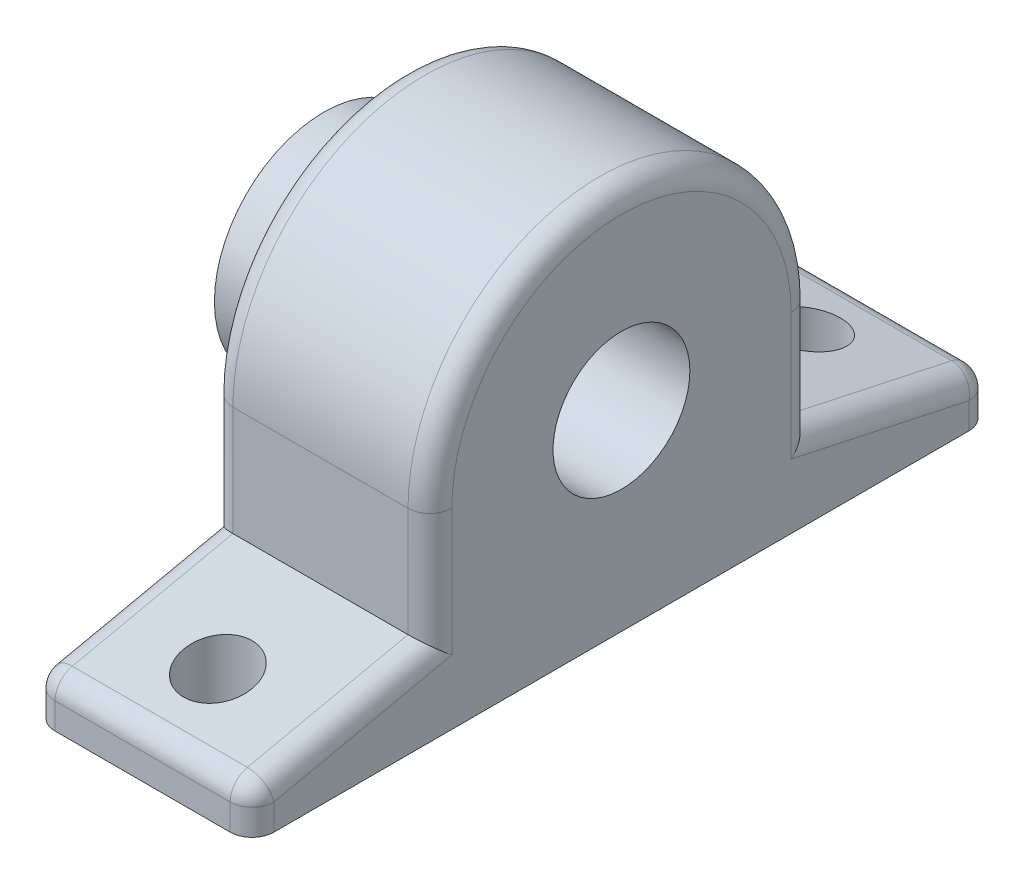
ISO-10303-21;
HEADER;
FILE_DESCRIPTION(('STEP AP214'),'2;1');
FILE_NAME('part.step','',(''),(''),'','','');
FILE_SCHEMA(('AUTOMOTIVE_DESIGN { 1 0 10303 214 1 1 1 1 }'));
ENDSEC;
DATA;
#1=APPLICATION_CONTEXT('core data for automotive mechanical design processes');
#2=APPLICATION_PROTOCOL_DEFINITION('international standard','automotive_design',2000,#1);
#3=PRODUCT_CONTEXT('',#1,'mechanical');
#4=PRODUCT('Part','Part','',(#3));
#5=PRODUCT_RELATED_PRODUCT_CATEGORY('part','',(#4));
#6=PRODUCT_DEFINITION_FORMATION('','',#4);
#7=PRODUCT_DEFINITION_CONTEXT('part definition',#1,'design');
#8=PRODUCT_DEFINITION('design','',#6,#7);
#9=PRODUCT_DEFINITION_SHAPE('','',#8);
#10=(LENGTH_UNIT() NAMED_UNIT(*) SI_UNIT(.MILLI.,.METRE.));
#11=(NAMED_UNIT(*) PLANE_ANGLE_UNIT() SI_UNIT($,.RADIAN.));
#12=(NAMED_UNIT(*) SI_UNIT($,.STERADIAN.) SOLID_ANGLE_UNIT());
#13=UNCERTAINTY_MEASURE_WITH_UNIT(LENGTH_MEASURE(1.E-05),#10,'distance_accuracy_value','');
#14=(GEOMETRIC_REPRESENTATION_CONTEXT(3) GLOBAL_UNCERTAINTY_ASSIGNED_CONTEXT((#13)) GLOBAL_UNIT_ASSIGNED_CONTEXT((#10,
#11,#12)) REPRESENTATION_CONTEXT('',''));
#15=CARTESIAN_POINT('',(0.,0.,0.));
#16=DIRECTION('',(0.,0.,1.));
#17=DIRECTION('',(1.,0.,0.));
#18=AXIS2_PLACEMENT_3D('',#15,#16,#17);
#19=CARTESIAN_POINT('',(0.,-15.6978882213575,-80.5063720271761));
#20=DIRECTION('',(1.,0.,0.));
#21=DIRECTION('',(0.,0.,-1.));
#22=AXIS2_PLACEMENT_3D('',#19,#20,#21);
#23=PLANE('',#22);
#24=DIRECTION('',(0.,-0.210556075945089,-0.977581781173629));
#25=VECTOR('',#24,1.);
#26=CARTESIAN_POINT('',(0.,-19.628057724181,-42.3276875670995));
#27=LINE('',#26,#25);
#28=CARTESIAN_POINT('',(0.,-14.7511711712673,-19.685));
#29=VERTEX_POINT('',#28);
#30=CARTESIAN_POINT('',(0.,-19.1961711712673,-40.3225));
#31=VERTEX_POINT('',#30);
#32=EDGE_CURVE('E231',#29,#31,#27,.T.);
#33=ORIENTED_EDGE('',*,*,#32,.T.);
#34=DIRECTION('',(0.,1.,0.));
#35=VECTOR('',#34,1.);
#36=CARTESIAN_POINT('',(0.,-15.6978882213575,-40.3225));
#37=LINE('',#36,#35);
#38=CARTESIAN_POINT('',(0.,-22.225,-40.3225));
#39=VERTEX_POINT('',#38);
#40=EDGE_CURVE('E244',#31,#39,#37,.F.);
#41=ORIENTED_EDGE('',*,*,#40,.T.);
#42=DIRECTION('',(0.,0.,1.));
#43=VECTOR('',#42,1.);
#44=CARTESIAN_POINT('',(0.,-22.225,-80.5063720271761));
#45=LINE('',#44,#43);
#46=CARTESIAN_POINT('',(0.,-22.225,40.3225));
#47=VERTEX_POINT('',#46);
#48=EDGE_CURVE('E319',#39,#47,#45,.T.);
#49=ORIENTED_EDGE('',*,*,#48,.T.);
#50=DIRECTION('',(0.,1.,0.));
#51=VECTOR('',#50,1.);
#52=CARTESIAN_POINT('',(0.,-19.1961711712673,40.3225));
#53=LINE('',#52,#51);
#54=CARTESIAN_POINT('',(0.,-19.1961711712673,40.3225));
#55=VERTEX_POINT('',#54);
#56=EDGE_CURVE('E217',#47,#55,#53,.T.);
#57=ORIENTED_EDGE('',*,*,#56,.T.);
#58=DIRECTION('',(0.,0.210556075945089,-0.97758178117363));
#59=VECTOR('',#58,1.);
#60=CARTESIAN_POINT('',(0.,-14.6359808011041,19.1501875670995));
#61=LINE('',#60,#59);
#62=CARTESIAN_POINT('',(0.,-14.7511711712673,19.685));
#63=VERTEX_POINT('',#62);
#64=EDGE_CURVE('E214',#55,#63,#61,.T.);
#65=ORIENTED_EDGE('',*,*,#64,.T.);
#66=DIRECTION('',(0.,-1.,0.));
#67=VECTOR('',#66,1.);
#68=CARTESIAN_POINT('',(0.,-15.6978882213575,19.685));
#69=LINE('',#68,#67);
#70=CARTESIAN_POINT('',(0.,0.,19.685));
#71=VERTEX_POINT('',#70);
#72=EDGE_CURVE('E208',#63,#71,#69,.F.);
#73=ORIENTED_EDGE('',*,*,#72,.T.);
#74=CARTESIAN_POINT('',(0.,0.,0.));
#75=DIRECTION('',(1.,0.,0.));
#76=DIRECTION('',(0.,0.,-1.));
#77=AXIS2_PLACEMENT_3D('',#74,#75,#76);
#78=CIRCLE('',#77,19.685);
#79=CARTESIAN_POINT('',(0.,0.,-19.685));
#80=VERTEX_POINT('',#79);
#81=EDGE_CURVE('E204',#71,#80,#78,.F.);
#82=ORIENTED_EDGE('',*,*,#81,.T.);
#83=DIRECTION('',(0.,-1.,0.));
#84=VECTOR('',#83,1.);
#85=CARTESIAN_POINT('',(0.,-12.7,-19.685));
#86=LINE('',#85,#84);
#87=EDGE_CURVE('E206',#80,#29,#86,.T.);
#88=ORIENTED_EDGE('',*,*,#87,.T.);
#89=EDGE_LOOP('',(#33,#41,#49,#57,#65,#73,#82,#88));
#90=FACE_BOUND('',#89,.T.);
#91=CARTESIAN_POINT('',(0.,0.,0.));
#92=DIRECTION('',(1.,0.,0.));
#93=DIRECTION('',(0.,0.,-1.));
#94=AXIS2_PLACEMENT_3D('',#91,#92,#93);
#95=CIRCLE('',#94,12.7);
#96=CARTESIAN_POINT('',(0.,0.,-12.7));
#97=VERTEX_POINT('',#96);
#98=EDGE_CURVE('E11',#97,#97,#95,.F.);
#99=ORIENTED_EDGE('',*,*,#98,.F.);
#100=EDGE_LOOP('',(#99));
#101=FACE_BOUND('',#100,.T.);
#102=ADVANCED_FACE('F33',(#90,#101),#23,.F.);
#103=CARTESIAN_POINT('',(25.4,0.,0.));
#104=DIRECTION('',(-1.,0.,0.));
#105=DIRECTION('',(0.,0.,1.));
#106=AXIS2_PLACEMENT_3D('',#103,#104,#105);
#107=CYLINDRICAL_SURFACE('',#106,22.225);
#108=DIRECTION('',(-1.,0.,0.));
#109=VECTOR('',#108,1.);
#110=CARTESIAN_POINT('',(25.4,0.,-22.225));
#111=LINE('',#110,#109);
#112=CARTESIAN_POINT('',(22.86,0.,-22.225));
#113=VERTEX_POINT('',#112);
#114=CARTESIAN_POINT('',(2.54,0.,-22.225));
#115=VERTEX_POINT('',#114);
#116=EDGE_CURVE('E323',#113,#115,#111,.T.);
#117=ORIENTED_EDGE('',*,*,#116,.T.);
#118=CARTESIAN_POINT('',(2.54,0.,0.));
#119=DIRECTION('',(1.,0.,0.));
#120=DIRECTION('',(0.,0.,-1.));
#121=AXIS2_PLACEMENT_3D('',#118,#119,#120);
#122=CIRCLE('',#121,22.225);
#123=CARTESIAN_POINT('',(2.54,0.,22.225));
#124=VERTEX_POINT('',#123);
#125=EDGE_CURVE('E212',#115,#124,#122,.T.);
#126=ORIENTED_EDGE('',*,*,#125,.T.);
#127=DIRECTION('',(-1.,0.,0.));
#128=VECTOR('',#127,1.);
#129=CARTESIAN_POINT('',(25.4,0.,22.225));
#130=LINE('',#129,#128);
#131=CARTESIAN_POINT('',(22.86,0.,22.225));
#132=VERTEX_POINT('',#131);
#133=EDGE_CURVE('E182',#132,#124,#130,.T.);
#134=ORIENTED_EDGE('',*,*,#133,.F.);
#135=CARTESIAN_POINT('',(22.86,0.,0.));
#136=DIRECTION('',(1.,0.,0.));
#137=DIRECTION('',(0.,0.,-1.));
#138=AXIS2_PLACEMENT_3D('',#135,#136,#137);
#139=CIRCLE('',#138,22.225);
#140=EDGE_CURVE('E197',#132,#113,#139,.F.);
#141=ORIENTED_EDGE('',*,*,#140,.T.);
#142=EDGE_LOOP('',(#117,#126,#134,#141));
#143=FACE_BOUND('',#142,.T.);
#144=ADVANCED_FACE('F35',(#143),#107,.T.);
#145=CARTESIAN_POINT('',(25.4,-15.6978882213575,22.225));
#146=DIRECTION('',(0.,0.,-1.));
#147=DIRECTION('',(-1.,0.,0.));
#148=AXIS2_PLACEMENT_3D('',#145,#146,#147);
#149=PLANE('',#148);
#150=ORIENTED_EDGE('',*,*,#133,.T.);
#151=DIRECTION('',(0.,-1.,0.));
#152=VECTOR('',#151,1.);
#153=CARTESIAN_POINT('',(2.54,-15.6978882213575,22.225));
#154=LINE('',#153,#152);
#155=CARTESIAN_POINT('',(2.54,-12.7,22.225));
#156=VERTEX_POINT('',#155);
#157=EDGE_CURVE('E171',#124,#156,#154,.T.);
#158=ORIENTED_EDGE('',*,*,#157,.T.);
#159=DIRECTION('',(-1.,0.,0.));
#160=VECTOR('',#159,1.);
#161=CARTESIAN_POINT('',(25.4,-12.7,22.225));
#162=LINE('',#161,#160);
#163=CARTESIAN_POINT('',(22.86,-12.7,22.225));
#164=VERTEX_POINT('',#163);
#165=EDGE_CURVE('E178',#164,#156,#162,.T.);
#166=ORIENTED_EDGE('',*,*,#165,.F.);
#167=DIRECTION('',(0.,-1.,0.));
#168=VECTOR('',#167,1.);
#169=CARTESIAN_POINT('',(22.86,0.,22.225));
#170=LINE('',#169,#168);
#171=EDGE_CURVE('E172',#164,#132,#170,.F.);
#172=ORIENTED_EDGE('',*,*,#171,.T.);
#173=EDGE_LOOP('',(#150,#158,#166,#172));
#174=FACE_BOUND('',#173,.T.);
#175=ADVANCED_FACE('F187',(#174),#149,.F.);
#176=CARTESIAN_POINT('',(25.4,8.312884517834,-75.334820975658));
#177=DIRECTION('',(0.,0.977581781173629,0.210556075945089));
#178=DIRECTION('',(0.,-0.210556075945089,0.97758178117363));
#179=AXIS2_PLACEMENT_3D('',#176,#177,#178);
#180=PLANE('',#179);
#181=CARTESIAN_POINT('',(12.7,-15.2644230769231,34.13125));
#182=DIRECTION('',(0.,0.977581781173629,0.210556075945089));
#183=DIRECTION('',(0.,-0.210556075945089,0.97758178117363));
#184=AXIS2_PLACEMENT_3D('',#181,#182,#183);
#185=ELLIPSE('',#184,4.05976264741283,3.96875000000001);
#186=CARTESIAN_POINT('',(12.7,-16.1192307692308,38.1));
#187=VERTEX_POINT('',#186);
#188=EDGE_CURVE('E272',#187,#187,#185,.T.);
#189=ORIENTED_EDGE('',*,*,#188,.F.);
#190=EDGE_LOOP('',(#189));
#191=FACE_BOUND('',#190,.T.);
#192=ORIENTED_EDGE('',*,*,#165,.T.);
#193=DIRECTION('',(0.,0.210556075945089,-0.97758178117363));
#194=VECTOR('',#193,1.);
#195=CARTESIAN_POINT('',(2.54,-16.7131134470863,40.8573124329006));
#196=LINE('',#195,#194);
#197=CARTESIAN_POINT('',(2.54,-16.7131134470863,40.8573124329005));
#198=VERTEX_POINT('',#197);
#199=EDGE_CURVE('E227',#156,#198,#196,.F.);
#200=ORIENTED_EDGE('',*,*,#199,.T.);
#201=DIRECTION('',(-1.,0.,0.));
#202=VECTOR('',#201,1.);
#203=CARTESIAN_POINT('',(25.4,-16.7131134470863,40.8573124329005));
#204=LINE('',#203,#202);
#205=CARTESIAN_POINT('',(22.86,-16.7131134470863,40.8573124329006));
#206=VERTEX_POINT('',#205);
#207=EDGE_CURVE('E181',#198,#206,#204,.F.);
#208=ORIENTED_EDGE('',*,*,#207,.T.);
#209=DIRECTION('',(0.,0.210556075945089,-0.97758178117363));
#210=VECTOR('',#209,1.);
#211=CARTESIAN_POINT('',(22.86,8.312884517834,-75.334820975658));
#212=LINE('',#211,#210);
#213=EDGE_CURVE('E163',#206,#164,#212,.T.);
#214=ORIENTED_EDGE('',*,*,#213,.T.);
#215=EDGE_LOOP('',(#192,#200,#208,#214));
#216=FACE_BOUND('',#215,.T.);
#217=ADVANCED_FACE('F177',(#191,#216),#180,.T.);
#218=CARTESIAN_POINT('',(25.4,-15.6978882213575,42.8625));
#219=DIRECTION('',(0.,0.,1.));
#220=DIRECTION('',(1.,0.,0.));
#221=AXIS2_PLACEMENT_3D('',#218,#219,#220);
#222=PLANE('',#221);
#223=DIRECTION('',(-1.,0.,0.));
#224=VECTOR('',#223,1.);
#225=CARTESIAN_POINT('',(25.4,-19.1961711712673,42.8625));
#226=LINE('',#225,#224);
#227=CARTESIAN_POINT('',(22.86,-19.1961711712673,42.8625));
#228=VERTEX_POINT('',#227);
#229=CARTESIAN_POINT('',(2.54,-19.1961711712673,42.8625));
#230=VERTEX_POINT('',#229);
#231=EDGE_CURVE('E335',#228,#230,#226,.T.);
#232=ORIENTED_EDGE('',*,*,#231,.T.);
#233=DIRECTION('',(0.,1.,0.));
#234=VECTOR('',#233,1.);
#235=CARTESIAN_POINT('',(2.54,-22.225,42.8625));
#236=LINE('',#235,#234);
#237=CARTESIAN_POINT('',(2.54,-22.225,42.8625));
#238=VERTEX_POINT('',#237);
#239=EDGE_CURVE('E220',#230,#238,#236,.F.);
#240=ORIENTED_EDGE('',*,*,#239,.T.);
#241=DIRECTION('',(-1.,0.,0.));
#242=VECTOR('',#241,1.);
#243=CARTESIAN_POINT('',(25.4,-22.225,42.8625));
#244=LINE('',#243,#242);
#245=CARTESIAN_POINT('',(22.86,-22.225,42.8625));
#246=VERTEX_POINT('',#245);
#247=EDGE_CURVE('E190',#246,#238,#244,.T.);
#248=ORIENTED_EDGE('',*,*,#247,.F.);
#249=DIRECTION('',(0.,1.,0.));
#250=VECTOR('',#249,1.);
#251=CARTESIAN_POINT('',(22.86,-15.6978882213575,42.8625));
#252=LINE('',#251,#250);
#253=EDGE_CURVE('E338',#246,#228,#252,.T.);
#254=ORIENTED_EDGE('',*,*,#253,.T.);
#255=EDGE_LOOP('',(#232,#240,#248,#254));
#256=FACE_BOUND('',#255,.T.);
#257=ADVANCED_FACE('F436',(#256),#222,.T.);
#258=CARTESIAN_POINT('',(25.4,-22.225,-80.5063720271761));
#259=DIRECTION('',(0.,-1.,0.));
#260=DIRECTION('',(0.,0.,-1.));
#261=AXIS2_PLACEMENT_3D('',#258,#259,#260);
#262=PLANE('',#261);
#263=CARTESIAN_POINT('',(12.7,-22.225,-34.13125));
#264=DIRECTION('',(0.,-1.,0.));
#265=DIRECTION('',(0.,0.,-1.));
#266=AXIS2_PLACEMENT_3D('',#263,#264,#265);
#267=CIRCLE('',#266,3.96875);
#268=CARTESIAN_POINT('',(12.7,-22.225,-38.1));
#269=VERTEX_POINT('',#268);
#270=EDGE_CURVE('E268',#269,#269,#267,.T.);
#271=ORIENTED_EDGE('',*,*,#270,.F.);
#272=EDGE_LOOP('',(#271));
#273=FACE_BOUND('',#272,.T.);
#274=CARTESIAN_POINT('',(12.7,-22.225,34.13125));
#275=DIRECTION('',(0.,-1.,0.));
#276=DIRECTION('',(0.,0.,-1.));
#277=AXIS2_PLACEMENT_3D('',#274,#275,#276);
#278=CIRCLE('',#277,3.96875000000001);
#279=CARTESIAN_POINT('',(12.7,-22.225,30.1625));
#280=VERTEX_POINT('',#279);
#281=EDGE_CURVE('E267',#280,#280,#278,.T.);
#282=ORIENTED_EDGE('',*,*,#281,.F.);
#283=EDGE_LOOP('',(#282));
#284=FACE_BOUND('',#283,.T.);
#285=DIRECTION('',(-1.,0.,0.));
#286=VECTOR('',#285,1.);
#287=CARTESIAN_POINT('',(25.4,-22.225,-42.8625));
#288=LINE('',#287,#286);
#289=CARTESIAN_POINT('',(22.86,-22.225,-42.8625));
#290=VERTEX_POINT('',#289);
#291=CARTESIAN_POINT('',(2.54,-22.225,-42.8625));
#292=VERTEX_POINT('',#291);
#293=EDGE_CURVE('E329',#290,#292,#288,.T.);
#294=ORIENTED_EDGE('',*,*,#293,.F.);
#295=CARTESIAN_POINT('',(22.86,-22.225,-40.3225));
#296=DIRECTION('',(0.,-1.,0.));
#297=DIRECTION('',(0.,0.,-1.));
#298=AXIS2_PLACEMENT_3D('',#295,#296,#297);
#299=CIRCLE('',#298,2.54);
#300=CARTESIAN_POINT('',(25.4,-22.225,-40.3225));
#301=VERTEX_POINT('',#300);
#302=EDGE_CURVE('E261',#290,#301,#299,.T.);
#303=ORIENTED_EDGE('',*,*,#302,.T.);
#304=DIRECTION('',(0.,0.,1.));
#305=VECTOR('',#304,1.);
#306=CARTESIAN_POINT('',(25.4,-22.225,-80.5063720271761));
#307=LINE('',#306,#305);
#308=CARTESIAN_POINT('',(25.4,-22.225,40.3225));
#309=VERTEX_POINT('',#308);
#310=EDGE_CURVE('E321',#301,#309,#307,.T.);
#311=ORIENTED_EDGE('',*,*,#310,.T.);
#312=CARTESIAN_POINT('',(22.86,-22.225,40.3225));
#313=DIRECTION('',(0.,-1.,0.));
#314=DIRECTION('',(0.,0.,-1.));
#315=AXIS2_PLACEMENT_3D('',#312,#313,#314);
#316=CIRCLE('',#315,2.54);
#317=EDGE_CURVE('E344',#309,#246,#316,.T.);
#318=ORIENTED_EDGE('',*,*,#317,.T.);
#319=ORIENTED_EDGE('',*,*,#247,.T.);
#320=CARTESIAN_POINT('',(2.54,-22.225,40.3225));
#321=DIRECTION('',(0.,-1.,0.));
#322=DIRECTION('',(0.,0.,-1.));
#323=AXIS2_PLACEMENT_3D('',#320,#321,#322);
#324=CIRCLE('',#323,2.54);
#325=EDGE_CURVE('E222',#238,#47,#324,.T.);
#326=ORIENTED_EDGE('',*,*,#325,.T.);
#327=ORIENTED_EDGE('',*,*,#48,.F.);
#328=CARTESIAN_POINT('',(2.54,-22.225,-40.3225));
#329=DIRECTION('',(0.,-1.,0.));
#330=DIRECTION('',(0.,0.,-1.));
#331=AXIS2_PLACEMENT_3D('',#328,#329,#330);
#332=CIRCLE('',#331,2.54);
#333=EDGE_CURVE('E246',#39,#292,#332,.T.);
#334=ORIENTED_EDGE('',*,*,#333,.T.);
#335=EDGE_LOOP('',(#294,#303,#311,#318,#319,#326,#327,#334));
#336=FACE_BOUND('',#335,.T.);
#337=ADVANCED_FACE('F388',(#273,#284,#336),#262,.T.);
#338=CARTESIAN_POINT('',(25.4,-15.6978882213575,-42.8625));
#339=DIRECTION('',(0.,0.,1.));
#340=DIRECTION('',(1.,0.,0.));
#341=AXIS2_PLACEMENT_3D('',#338,#339,#340);
#342=PLANE('',#341);
#343=DIRECTION('',(-1.,0.,0.));
#344=VECTOR('',#343,1.);
#345=CARTESIAN_POINT('',(25.4,-19.1961711712673,-42.8625));
#346=LINE('',#345,#344);
#347=CARTESIAN_POINT('',(2.54,-19.1961711712673,-42.8625));
#348=VERTEX_POINT('',#347);
#349=CARTESIAN_POINT('',(22.86,-19.1961711712673,-42.8625));
#350=VERTEX_POINT('',#349);
#351=EDGE_CURVE('E239',#348,#350,#346,.F.);
#352=ORIENTED_EDGE('',*,*,#351,.T.);
#353=DIRECTION('',(0.,1.,0.));
#354=VECTOR('',#353,1.);
#355=CARTESIAN_POINT('',(22.86,-22.225,-42.8625));
#356=LINE('',#355,#354);
#357=EDGE_CURVE('E259',#350,#290,#356,.F.);
#358=ORIENTED_EDGE('',*,*,#357,.T.);
#359=ORIENTED_EDGE('',*,*,#293,.T.);
#360=DIRECTION('',(0.,1.,0.));
#361=VECTOR('',#360,1.);
#362=CARTESIAN_POINT('',(2.54,-15.6978882213575,-42.8625));
#363=LINE('',#362,#361);
#364=EDGE_CURVE('E241',#292,#348,#363,.T.);
#365=ORIENTED_EDGE('',*,*,#364,.T.);
#366=EDGE_LOOP('',(#352,#358,#359,#365));
#367=FACE_BOUND('',#366,.T.);
#368=ADVANCED_FACE('F386',(#367),#342,.F.);
#369=CARTESIAN_POINT('',(25.4,-24.8292998498341,-78.5396064456581));
#370=DIRECTION('',(0.,0.977581781173629,-0.210556075945089));
#371=DIRECTION('',(0.,0.210556075945089,0.977581781173629));
#372=AXIS2_PLACEMENT_3D('',#369,#370,#371);
#373=PLANE('',#372);
#374=CARTESIAN_POINT('',(12.7,-15.2644230769231,-34.13125));
#375=DIRECTION('',(0.,0.977581781173629,-0.210556075945089));
#376=DIRECTION('',(0.,-0.210556075945089,-0.977581781173629));
#377=AXIS2_PLACEMENT_3D('',#374,#375,#376);
#378=ELLIPSE('',#377,4.05976264741283,3.96875);
#379=CARTESIAN_POINT('',(12.7,-16.1192307692308,-38.1));
#380=VERTEX_POINT('',#379);
#381=EDGE_CURVE('E265',#380,#380,#378,.T.);
#382=ORIENTED_EDGE('',*,*,#381,.F.);
#383=EDGE_LOOP('',(#382));
#384=FACE_BOUND('',#383,.T.);
#385=DIRECTION('',(-1.,0.,0.));
#386=VECTOR('',#385,1.);
#387=CARTESIAN_POINT('',(25.4,-12.7,-22.225));
#388=LINE('',#387,#386);
#389=CARTESIAN_POINT('',(22.86,-12.7,-22.225));
#390=VERTEX_POINT('',#389);
#391=CARTESIAN_POINT('',(2.54,-12.7,-22.225));
#392=VERTEX_POINT('',#391);
#393=EDGE_CURVE('E326',#390,#392,#388,.T.);
#394=ORIENTED_EDGE('',*,*,#393,.F.);
#395=DIRECTION('',(0.,-0.210556075945089,-0.977581781173629));
#396=VECTOR('',#395,1.);
#397=CARTESIAN_POINT('',(22.86,-24.8292998498341,-78.5396064456581));
#398=LINE('',#397,#396);
#399=CARTESIAN_POINT('',(22.86,-16.7131134470863,-40.8573124329005));
#400=VERTEX_POINT('',#399);
#401=EDGE_CURVE('E48',#390,#400,#398,.T.);
#402=ORIENTED_EDGE('',*,*,#401,.T.);
#403=DIRECTION('',(-1.,0.,0.));
#404=VECTOR('',#403,1.);
#405=CARTESIAN_POINT('',(2.54,-16.7131134470863,-40.8573124329005));
#406=LINE('',#405,#404);
#407=CARTESIAN_POINT('',(2.54,-16.7131134470863,-40.8573124329005));
#408=VERTEX_POINT('',#407);
#409=EDGE_CURVE('E251',#400,#408,#406,.T.);
#410=ORIENTED_EDGE('',*,*,#409,.T.);
#411=DIRECTION('',(0.,-0.210556075945089,-0.977581781173629));
#412=VECTOR('',#411,1.);
#413=CARTESIAN_POINT('',(2.54,-12.1529230769231,-19.685));
#414=LINE('',#413,#412);
#415=EDGE_CURVE('E234',#408,#392,#414,.F.);
#416=ORIENTED_EDGE('',*,*,#415,.T.);
#417=EDGE_LOOP('',(#394,#402,#410,#416));
#418=FACE_BOUND('',#417,.T.);
#419=ADVANCED_FACE('F371',(#384,#418),#373,.T.);
#420=CARTESIAN_POINT('',(25.4,-15.6978882213575,-22.225));
#421=DIRECTION('',(0.,0.,-1.));
#422=DIRECTION('',(-1.,0.,0.));
#423=AXIS2_PLACEMENT_3D('',#420,#421,#422);
#424=PLANE('',#423);
#425=ORIENTED_EDGE('',*,*,#393,.T.);
#426=DIRECTION('',(0.,-1.,0.));
#427=VECTOR('',#426,1.);
#428=CARTESIAN_POINT('',(2.54,0.,-22.225));
#429=LINE('',#428,#427);
#430=EDGE_CURVE('E210',#392,#115,#429,.F.);
#431=ORIENTED_EDGE('',*,*,#430,.T.);
#432=ORIENTED_EDGE('',*,*,#116,.F.);
#433=DIRECTION('',(0.,-1.,0.));
#434=VECTOR('',#433,1.);
#435=CARTESIAN_POINT('',(22.86,-15.6978882213575,-22.225));
#436=LINE('',#435,#434);
#437=EDGE_CURVE('E349',#113,#390,#436,.T.);
#438=ORIENTED_EDGE('',*,*,#437,.T.);
#439=EDGE_LOOP('',(#425,#431,#432,#438));
#440=FACE_BOUND('',#439,.T.);
#441=ADVANCED_FACE('F369',(#440),#424,.T.);
#442=CARTESIAN_POINT('',(25.4,-15.6978882213575,-80.5063720271761));
#443=DIRECTION('',(1.,0.,0.));
#444=DIRECTION('',(0.,0.,-1.));
#445=AXIS2_PLACEMENT_3D('',#442,#443,#444);
#446=PLANE('',#445);
#447=CARTESIAN_POINT('',(25.4,0.,0.));
#448=DIRECTION('',(1.,0.,0.));
#449=DIRECTION('',(0.,0.,-1.));
#450=AXIS2_PLACEMENT_3D('',#447,#448,#449);
#451=CIRCLE('',#450,7.9375);
#452=CARTESIAN_POINT('',(25.4,0.,-7.9375));
#453=VERTEX_POINT('',#452);
#454=EDGE_CURVE('E316',#453,#453,#451,.T.);
#455=ORIENTED_EDGE('',*,*,#454,.F.);
#456=EDGE_LOOP('',(#455));
#457=FACE_BOUND('',#456,.T.);
#458=ORIENTED_EDGE('',*,*,#310,.F.);
#459=DIRECTION('',(0.,1.,0.));
#460=VECTOR('',#459,1.);
#461=CARTESIAN_POINT('',(25.4,-19.1961711712673,-40.3225));
#462=LINE('',#461,#460);
#463=CARTESIAN_POINT('',(25.4,-19.1961711712673,-40.3225));
#464=VERTEX_POINT('',#463);
#465=EDGE_CURVE('E256',#301,#464,#462,.T.);
#466=ORIENTED_EDGE('',*,*,#465,.T.);
#467=DIRECTION('',(0.,-0.210556075945089,-0.977581781173629));
#468=VECTOR('',#467,1.);
#469=CARTESIAN_POINT('',(25.4,-27.3123575740151,-78.0047940127576));
#470=LINE('',#469,#468);
#471=CARTESIAN_POINT('',(25.4,-14.7511711712673,-19.685));
#472=VERTEX_POINT('',#471);
#473=EDGE_CURVE('E253',#464,#472,#470,.F.);
#474=ORIENTED_EDGE('',*,*,#473,.T.);
#475=DIRECTION('',(0.,-1.,0.));
#476=VECTOR('',#475,1.);
#477=CARTESIAN_POINT('',(25.4,-15.6978882213575,-19.685));
#478=LINE('',#477,#476);
#479=CARTESIAN_POINT('',(25.4,0.,-19.685));
#480=VERTEX_POINT('',#479);
#481=EDGE_CURVE('E199',#472,#480,#478,.F.);
#482=ORIENTED_EDGE('',*,*,#481,.T.);
#483=CARTESIAN_POINT('',(25.4,0.,0.));
#484=DIRECTION('',(1.,0.,0.));
#485=DIRECTION('',(0.,0.,-1.));
#486=AXIS2_PLACEMENT_3D('',#483,#484,#485);
#487=CIRCLE('',#486,19.685);
#488=CARTESIAN_POINT('',(25.4,0.,19.685));
#489=VERTEX_POINT('',#488);
#490=EDGE_CURVE('E354',#480,#489,#487,.T.);
#491=ORIENTED_EDGE('',*,*,#490,.T.);
#492=DIRECTION('',(0.,-1.,0.));
#493=VECTOR('',#492,1.);
#494=CARTESIAN_POINT('',(25.4,-15.2982480943442,19.685));
#495=LINE('',#494,#493);
#496=CARTESIAN_POINT('',(25.4,-14.7511711712673,19.685));
#497=VERTEX_POINT('',#496);
#498=EDGE_CURVE('E352',#489,#497,#495,.T.);
#499=ORIENTED_EDGE('',*,*,#498,.T.);
#500=DIRECTION('',(0.,0.210556075945089,-0.97758178117363));
#501=VECTOR('',#500,1.);
#502=CARTESIAN_POINT('',(25.4,5.82982679365298,-75.8696334085585));
#503=LINE('',#502,#501);
#504=CARTESIAN_POINT('',(25.4,-19.1961711712673,40.3225));
#505=VERTEX_POINT('',#504);
#506=EDGE_CURVE('E166',#497,#505,#503,.F.);
#507=ORIENTED_EDGE('',*,*,#506,.T.);
#508=DIRECTION('',(0.,1.,0.));
#509=VECTOR('',#508,1.);
#510=CARTESIAN_POINT('',(25.4,-15.6978882213575,40.3225));
#511=LINE('',#510,#509);
#512=EDGE_CURVE('E341',#505,#309,#511,.F.);
#513=ORIENTED_EDGE('',*,*,#512,.T.);
#514=EDGE_LOOP('',(#458,#466,#474,#482,#491,#499,#507,#513));
#515=FACE_BOUND('',#514,.T.);
#516=ADVANCED_FACE('F358',(#457,#515),#446,.T.);
#517=CARTESIAN_POINT('',(0.,0.,0.));
#518=DIRECTION('',(1.,0.,0.));
#519=DIRECTION('',(0.,0.,-1.));
#520=AXIS2_PLACEMENT_3D('',#517,#518,#519);
#521=CYLINDRICAL_SURFACE('',#520,7.9375);
#522=ORIENTED_EDGE('',*,*,#454,.T.);
#523=EDGE_LOOP('',(#522));
#524=FACE_BOUND('',#523,.T.);
#525=CARTESIAN_POINT('',(-9.128125,0.,0.));
#526=DIRECTION('',(-1.,0.,0.));
#527=DIRECTION('',(0.,0.,1.));
#528=AXIS2_PLACEMENT_3D('',#525,#526,#527);
#529=CIRCLE('',#528,7.9375);
#530=CARTESIAN_POINT('',(-9.128125,0.,7.9375));
#531=VERTEX_POINT('',#530);
#532=EDGE_CURVE('E280',#531,#531,#529,.T.);
#533=ORIENTED_EDGE('',*,*,#532,.T.);
#534=EDGE_LOOP('',(#533));
#535=FACE_BOUND('',#534,.T.);
#536=ADVANCED_FACE('F422',(#524,#535),#521,.F.);
#537=CARTESIAN_POINT('',(22.86,5.82982679365298,-75.8696334085585));
#538=DIRECTION('',(0.,0.210556075945089,-0.97758178117363));
#539=DIRECTION('',(0.,0.977581781173629,0.210556075945089));
#540=AXIS2_PLACEMENT_3D('',#537,#538,#539);
#541=CYLINDRICAL_SURFACE('',#540,2.54);
#542=ORIENTED_EDGE('',*,*,#213,.F.);
#543=CARTESIAN_POINT('',(22.86,-19.1961711712673,40.3225));
#544=DIRECTION('',(0.,0.210556075945089,-0.97758178117363));
#545=DIRECTION('',(0.,0.977581781173629,0.210556075945089));
#546=AXIS2_PLACEMENT_3D('',#543,#544,#545);
#547=CIRCLE('',#546,2.54);
#548=EDGE_CURVE('E346',#206,#505,#547,.T.);
#549=ORIENTED_EDGE('',*,*,#548,.T.);
#550=ORIENTED_EDGE('',*,*,#506,.F.);
#551=CARTESIAN_POINT('',(22.86,-14.7511711712673,19.685));
#552=DIRECTION('',(0.,0.777996168353382,-0.628269020426326));
#553=DIRECTION('',(0.,0.628269020426326,0.777996168353383));
#554=AXIS2_PLACEMENT_3D('',#551,#552,#553);
#555=ELLIPSE('',#554,3.26479757011641,2.54);
#556=EDGE_CURVE('E160',#497,#164,#555,.F.);
#557=ORIENTED_EDGE('',*,*,#556,.T.);
#558=EDGE_LOOP('',(#542,#549,#550,#557));
#559=FACE_BOUND('',#558,.T.);
#560=ADVANCED_FACE('F162',(#559),#541,.T.);
#561=CARTESIAN_POINT('',(25.4,-19.1961711712673,40.3225));
#562=DIRECTION('',(-1.,0.,0.));
#563=DIRECTION('',(0.,0.,1.));
#564=AXIS2_PLACEMENT_3D('',#561,#562,#563);
#565=CYLINDRICAL_SURFACE('',#564,2.54);
#566=ORIENTED_EDGE('',*,*,#207,.F.);
#567=CARTESIAN_POINT('',(2.54,-19.1961711712673,40.3225));
#568=DIRECTION('',(-1.,0.,0.));
#569=DIRECTION('',(0.,0.,1.));
#570=AXIS2_PLACEMENT_3D('',#567,#568,#569);
#571=CIRCLE('',#570,2.54);
#572=EDGE_CURVE('E225',#198,#230,#571,.F.);
#573=ORIENTED_EDGE('',*,*,#572,.T.);
#574=ORIENTED_EDGE('',*,*,#231,.F.);
#575=CARTESIAN_POINT('',(22.86,-19.1961711712673,40.3225));
#576=DIRECTION('',(1.,0.,0.));
#577=DIRECTION('',(0.,0.,-1.));
#578=AXIS2_PLACEMENT_3D('',#575,#576,#577);
#579=CIRCLE('',#578,2.54);
#580=EDGE_CURVE('E313',#206,#228,#579,.T.);
#581=ORIENTED_EDGE('',*,*,#580,.F.);
#582=EDGE_LOOP('',(#566,#573,#574,#581));
#583=FACE_BOUND('',#582,.T.);
#584=ADVANCED_FACE('F495',(#583),#565,.T.);
#585=CARTESIAN_POINT('',(22.86,-19.1961711712673,40.3225));
#586=DIRECTION('',(0.,0.,1.));
#587=DIRECTION('',(1.,0.,0.));
#588=AXIS2_PLACEMENT_3D('',#585,#586,#587);
#589=SPHERICAL_SURFACE('',#588,2.54);
#590=ORIENTED_EDGE('',*,*,#548,.F.);
#591=ORIENTED_EDGE('',*,*,#580,.T.);
#592=CARTESIAN_POINT('',(22.86,-19.1961711712673,40.3225));
#593=DIRECTION('',(0.,-1.,0.));
#594=DIRECTION('',(0.,0.,-1.));
#595=AXIS2_PLACEMENT_3D('',#592,#593,#594);
#596=CIRCLE('',#595,2.54);
#597=EDGE_CURVE('E311',#505,#228,#596,.T.);
#598=ORIENTED_EDGE('',*,*,#597,.F.);
#599=EDGE_LOOP('',(#590,#591,#598));
#600=FACE_BOUND('',#599,.T.);
#601=ADVANCED_FACE('F502',(#600),#589,.T.);
#602=CARTESIAN_POINT('',(22.86,-15.6978882213575,40.3225));
#603=DIRECTION('',(0.,1.,0.));
#604=DIRECTION('',(0.,0.,1.));
#605=AXIS2_PLACEMENT_3D('',#602,#603,#604);
#606=CYLINDRICAL_SURFACE('',#605,2.54);
#607=ORIENTED_EDGE('',*,*,#317,.F.);
#608=ORIENTED_EDGE('',*,*,#512,.F.);
#609=ORIENTED_EDGE('',*,*,#597,.T.);
#610=ORIENTED_EDGE('',*,*,#253,.F.);
#611=EDGE_LOOP('',(#607,#608,#609,#610));
#612=FACE_BOUND('',#611,.T.);
#613=ADVANCED_FACE('F511',(#612),#606,.T.);
#614=CARTESIAN_POINT('',(22.86,-15.6978882213575,19.685));
#615=DIRECTION('',(0.,1.,0.));
#616=DIRECTION('',(0.,0.,1.));
#617=AXIS2_PLACEMENT_3D('',#614,#615,#616);
#618=CYLINDRICAL_SURFACE('',#617,2.54);
#619=ORIENTED_EDGE('',*,*,#556,.F.);
#620=ORIENTED_EDGE('',*,*,#498,.F.);
#621=CARTESIAN_POINT('',(22.86,0.,19.685));
#622=DIRECTION('',(0.,1.,0.));
#623=DIRECTION('',(-1.,0.,0.));
#624=AXIS2_PLACEMENT_3D('',#621,#622,#623);
#625=CIRCLE('',#624,2.54);
#626=EDGE_CURVE('E195',#132,#489,#625,.T.);
#627=ORIENTED_EDGE('',*,*,#626,.F.);
#628=ORIENTED_EDGE('',*,*,#171,.F.);
#629=EDGE_LOOP('',(#619,#620,#627,#628));
#630=FACE_BOUND('',#629,.T.);
#631=ADVANCED_FACE('F193',(#630),#618,.T.);
#632=CARTESIAN_POINT('',(22.86,0.,0.));
#633=DIRECTION('',(1.,0.,0.));
#634=DIRECTION('',(0.,0.,-1.));
#635=AXIS2_PLACEMENT_3D('',#632,#633,#634);
#636=TOROIDAL_SURFACE('',#635,19.685,2.54);
#637=ORIENTED_EDGE('',*,*,#626,.T.);
#638=ORIENTED_EDGE('',*,*,#490,.F.);
#639=CARTESIAN_POINT('',(22.86,0.,-19.685));
#640=DIRECTION('',(0.,-1.,0.));
#641=DIRECTION('',(0.,0.,-1.));
#642=AXIS2_PLACEMENT_3D('',#639,#640,#641);
#643=CIRCLE('',#642,2.54);
#644=EDGE_CURVE('E307',#113,#480,#643,.T.);
#645=ORIENTED_EDGE('',*,*,#644,.F.);
#646=ORIENTED_EDGE('',*,*,#140,.F.);
#647=EDGE_LOOP('',(#637,#638,#645,#646));
#648=FACE_BOUND('',#647,.T.);
#649=ADVANCED_FACE('F364',(#648),#636,.T.);
#650=CARTESIAN_POINT('',(22.86,-15.6978882213575,-19.685));
#651=DIRECTION('',(0.,-1.,0.));
#652=DIRECTION('',(0.,0.,-1.));
#653=AXIS2_PLACEMENT_3D('',#650,#651,#652);
#654=CYLINDRICAL_SURFACE('',#653,2.54);
#655=ORIENTED_EDGE('',*,*,#644,.T.);
#656=ORIENTED_EDGE('',*,*,#481,.F.);
#657=CARTESIAN_POINT('',(22.86,-14.7511711712673,-19.685));
#658=DIRECTION('',(0.,-0.777996168353383,-0.628269020426326));
#659=DIRECTION('',(0.,0.628269020426326,-0.777996168353382));
#660=AXIS2_PLACEMENT_3D('',#657,#658,#659);
#661=ELLIPSE('',#660,3.26479757011641,2.54);
#662=EDGE_CURVE('E41',#472,#390,#661,.F.);
#663=ORIENTED_EDGE('',*,*,#662,.T.);
#664=ORIENTED_EDGE('',*,*,#437,.F.);
#665=EDGE_LOOP('',(#655,#656,#663,#664));
#666=FACE_BOUND('',#665,.T.);
#667=ADVANCED_FACE('F366',(#666),#654,.T.);
#668=CARTESIAN_POINT('',(2.54,-15.6978882213575,-19.685));
#669=DIRECTION('',(0.,1.,0.));
#670=DIRECTION('',(0.,0.,1.));
#671=AXIS2_PLACEMENT_3D('',#668,#669,#670);
#672=CYLINDRICAL_SURFACE('',#671,2.54);
#673=ORIENTED_EDGE('',*,*,#430,.F.);
#674=CARTESIAN_POINT('',(2.54,-14.7511711712673,-19.685));
#675=DIRECTION('',(0.,0.777996168353383,0.628269020426326));
#676=DIRECTION('',(0.,-0.628269020426326,0.777996168353382));
#677=AXIS2_PLACEMENT_3D('',#674,#675,#676);
#678=ELLIPSE('',#677,3.26479757011641,2.54);
#679=EDGE_CURVE('E236',#392,#29,#678,.T.);
#680=ORIENTED_EDGE('',*,*,#679,.T.);
#681=ORIENTED_EDGE('',*,*,#87,.F.);
#682=CARTESIAN_POINT('',(2.54,0.,-19.685));
#683=DIRECTION('',(0.,1.,0.));
#684=DIRECTION('',(0.,0.,1.));
#685=AXIS2_PLACEMENT_3D('',#682,#683,#684);
#686=CIRCLE('',#685,2.54);
#687=EDGE_CURVE('E304',#115,#80,#686,.T.);
#688=ORIENTED_EDGE('',*,*,#687,.F.);
#689=EDGE_LOOP('',(#673,#680,#681,#688));
#690=FACE_BOUND('',#689,.T.);
#691=ADVANCED_FACE('F535',(#690),#672,.T.);
#692=CARTESIAN_POINT('',(2.54,0.,0.));
#693=DIRECTION('',(1.,0.,0.));
#694=DIRECTION('',(0.,0.,-1.));
#695=AXIS2_PLACEMENT_3D('',#692,#693,#694);
#696=TOROIDAL_SURFACE('',#695,19.685,2.54);
#697=ORIENTED_EDGE('',*,*,#687,.T.);
#698=ORIENTED_EDGE('',*,*,#81,.F.);
#699=CARTESIAN_POINT('',(2.54,0.,19.685));
#700=DIRECTION('',(0.,-1.,0.));
#701=DIRECTION('',(0.,0.,-1.));
#702=AXIS2_PLACEMENT_3D('',#699,#700,#701);
#703=CIRCLE('',#702,2.54);
#704=EDGE_CURVE('E301',#124,#71,#703,.T.);
#705=ORIENTED_EDGE('',*,*,#704,.F.);
#706=ORIENTED_EDGE('',*,*,#125,.F.);
#707=EDGE_LOOP('',(#697,#698,#705,#706));
#708=FACE_BOUND('',#707,.T.);
#709=ADVANCED_FACE('F542',(#708),#696,.T.);
#710=CARTESIAN_POINT('',(2.54,-15.6978882213575,19.685));
#711=DIRECTION('',(0.,-1.,0.));
#712=DIRECTION('',(0.,0.,-1.));
#713=AXIS2_PLACEMENT_3D('',#710,#711,#712);
#714=CYLINDRICAL_SURFACE('',#713,2.54);
#715=ORIENTED_EDGE('',*,*,#704,.T.);
#716=ORIENTED_EDGE('',*,*,#72,.F.);
#717=CARTESIAN_POINT('',(2.54,-14.7511711712673,19.685));
#718=DIRECTION('',(0.,-0.777996168353382,0.628269020426326));
#719=DIRECTION('',(0.,0.628269020426326,0.777996168353383));
#720=AXIS2_PLACEMENT_3D('',#717,#718,#719);
#721=ELLIPSE('',#720,3.26479757011641,2.54);
#722=EDGE_CURVE('E229',#63,#156,#721,.F.);
#723=ORIENTED_EDGE('',*,*,#722,.T.);
#724=ORIENTED_EDGE('',*,*,#157,.F.);
#725=EDGE_LOOP('',(#715,#716,#723,#724));
#726=FACE_BOUND('',#725,.T.);
#727=ADVANCED_FACE('F551',(#726),#714,.T.);
#728=CARTESIAN_POINT('',(2.54,5.82982679365298,-75.8696334085585));
#729=DIRECTION('',(0.,-0.210556075945089,0.97758178117363));
#730=DIRECTION('',(0.,-0.977581781173629,-0.210556075945089));
#731=AXIS2_PLACEMENT_3D('',#728,#729,#730);
#732=CYLINDRICAL_SURFACE('',#731,2.54);
#733=CARTESIAN_POINT('',(2.54,-19.1961711712673,40.3225));
#734=DIRECTION('',(0.,-0.210556075945088,0.97758178117363));
#735=DIRECTION('',(0.,-0.97758178117363,-0.210556075945088));
#736=AXIS2_PLACEMENT_3D('',#733,#734,#735);
#737=CIRCLE('',#736,2.54);
#738=EDGE_CURVE('E298',#198,#55,#737,.T.);
#739=ORIENTED_EDGE('',*,*,#738,.F.);
#740=ORIENTED_EDGE('',*,*,#199,.F.);
#741=ORIENTED_EDGE('',*,*,#722,.F.);
#742=ORIENTED_EDGE('',*,*,#64,.F.);
#743=EDGE_LOOP('',(#739,#740,#741,#742));
#744=FACE_BOUND('',#743,.T.);
#745=ADVANCED_FACE('F558',(#744),#732,.T.);
#746=CARTESIAN_POINT('',(2.54,-19.1961711712673,40.3225));
#747=DIRECTION('',(0.,0.,1.));
#748=DIRECTION('',(1.,0.,0.));
#749=AXIS2_PLACEMENT_3D('',#746,#747,#748);
#750=SPHERICAL_SURFACE('',#749,2.54);
#751=ORIENTED_EDGE('',*,*,#572,.F.);
#752=ORIENTED_EDGE('',*,*,#738,.T.);
#753=CARTESIAN_POINT('',(2.54,-19.1961711712673,40.3225));
#754=DIRECTION('',(0.,-1.,0.));
#755=DIRECTION('',(0.,0.,-1.));
#756=AXIS2_PLACEMENT_3D('',#753,#754,#755);
#757=CIRCLE('',#756,2.54);
#758=EDGE_CURVE('E296',#230,#55,#757,.T.);
#759=ORIENTED_EDGE('',*,*,#758,.F.);
#760=EDGE_LOOP('',(#751,#752,#759));
#761=FACE_BOUND('',#760,.T.);
#762=ADVANCED_FACE('F566',(#761),#750,.T.);
#763=CARTESIAN_POINT('',(2.54,-15.6978882213575,40.3225));
#764=DIRECTION('',(0.,-1.,0.));
#765=DIRECTION('',(0.,0.,-1.));
#766=AXIS2_PLACEMENT_3D('',#763,#764,#765);
#767=CYLINDRICAL_SURFACE('',#766,2.54);
#768=ORIENTED_EDGE('',*,*,#325,.F.);
#769=ORIENTED_EDGE('',*,*,#239,.F.);
#770=ORIENTED_EDGE('',*,*,#758,.T.);
#771=ORIENTED_EDGE('',*,*,#56,.F.);
#772=EDGE_LOOP('',(#768,#769,#770,#771));
#773=FACE_BOUND('',#772,.T.);
#774=ADVANCED_FACE('F409',(#773),#767,.T.);
#775=CARTESIAN_POINT('',(2.54,-27.3123575740151,-78.0047940127576));
#776=DIRECTION('',(0.,0.210556075945089,0.977581781173629));
#777=DIRECTION('',(0.,-0.977581781173629,0.210556075945089));
#778=AXIS2_PLACEMENT_3D('',#775,#776,#777);
#779=CYLINDRICAL_SURFACE('',#778,2.54);
#780=ORIENTED_EDGE('',*,*,#415,.F.);
#781=CARTESIAN_POINT('',(2.54,-19.1961711712673,-40.3225));
#782=DIRECTION('',(0.,0.210556075945089,0.977581781173629));
#783=DIRECTION('',(0.,-0.977581781173629,0.210556075945089));
#784=AXIS2_PLACEMENT_3D('',#781,#782,#783);
#785=CIRCLE('',#784,2.54);
#786=EDGE_CURVE('E249',#408,#31,#785,.T.);
#787=ORIENTED_EDGE('',*,*,#786,.T.);
#788=ORIENTED_EDGE('',*,*,#32,.F.);
#789=ORIENTED_EDGE('',*,*,#679,.F.);
#790=EDGE_LOOP('',(#780,#787,#788,#789));
#791=FACE_BOUND('',#790,.T.);
#792=ADVANCED_FACE('F402',(#791),#779,.T.);
#793=CARTESIAN_POINT('',(25.4,-19.1961711712673,-40.3225));
#794=DIRECTION('',(1.,0.,0.));
#795=DIRECTION('',(0.,0.,-1.));
#796=AXIS2_PLACEMENT_3D('',#793,#794,#795);
#797=CYLINDRICAL_SURFACE('',#796,2.54);
#798=ORIENTED_EDGE('',*,*,#409,.F.);
#799=CARTESIAN_POINT('',(22.86,-19.1961711712673,-40.3225));
#800=DIRECTION('',(1.,0.,0.));
#801=DIRECTION('',(0.,0.,-1.));
#802=AXIS2_PLACEMENT_3D('',#799,#800,#801);
#803=CIRCLE('',#802,2.54);
#804=EDGE_CURVE('E55',#400,#350,#803,.F.);
#805=ORIENTED_EDGE('',*,*,#804,.T.);
#806=ORIENTED_EDGE('',*,*,#351,.F.);
#807=CARTESIAN_POINT('',(2.54,-19.1961711712673,-40.3225));
#808=DIRECTION('',(-1.,0.,0.));
#809=DIRECTION('',(0.,0.,1.));
#810=AXIS2_PLACEMENT_3D('',#807,#808,#809);
#811=CIRCLE('',#810,2.54);
#812=EDGE_CURVE('E293',#408,#348,#811,.T.);
#813=ORIENTED_EDGE('',*,*,#812,.F.);
#814=EDGE_LOOP('',(#798,#805,#806,#813));
#815=FACE_BOUND('',#814,.T.);
#816=ADVANCED_FACE('F400',(#815),#797,.T.);
#817=CARTESIAN_POINT('',(2.54,-19.1961711712673,-40.3225));
#818=DIRECTION('',(0.,0.,1.));
#819=DIRECTION('',(1.,0.,0.));
#820=AXIS2_PLACEMENT_3D('',#817,#818,#819);
#821=SPHERICAL_SURFACE('',#820,2.54);
#822=ORIENTED_EDGE('',*,*,#786,.F.);
#823=ORIENTED_EDGE('',*,*,#812,.T.);
#824=CARTESIAN_POINT('',(2.54,-19.1961711712673,-40.3225));
#825=DIRECTION('',(0.,-1.,0.));
#826=DIRECTION('',(0.,0.,-1.));
#827=AXIS2_PLACEMENT_3D('',#824,#825,#826);
#828=CIRCLE('',#827,2.54);
#829=EDGE_CURVE('E291',#31,#348,#828,.T.);
#830=ORIENTED_EDGE('',*,*,#829,.F.);
#831=EDGE_LOOP('',(#822,#823,#830));
#832=FACE_BOUND('',#831,.T.);
#833=ADVANCED_FACE('F399',(#832),#821,.T.);
#834=CARTESIAN_POINT('',(2.54,-15.6978882213575,-40.3225));
#835=DIRECTION('',(0.,1.,0.));
#836=DIRECTION('',(0.,0.,1.));
#837=AXIS2_PLACEMENT_3D('',#834,#835,#836);
#838=CYLINDRICAL_SURFACE('',#837,2.54);
#839=ORIENTED_EDGE('',*,*,#333,.F.);
#840=ORIENTED_EDGE('',*,*,#40,.F.);
#841=ORIENTED_EDGE('',*,*,#829,.T.);
#842=ORIENTED_EDGE('',*,*,#364,.F.);
#843=EDGE_LOOP('',(#839,#840,#841,#842));
#844=FACE_BOUND('',#843,.T.);
#845=ADVANCED_FACE('F394',(#844),#838,.T.);
#846=CARTESIAN_POINT('',(22.86,-27.3123575740151,-78.0047940127576));
#847=DIRECTION('',(0.,-0.210556075945089,-0.977581781173629));
#848=DIRECTION('',(0.,0.977581781173629,-0.210556075945089));
#849=AXIS2_PLACEMENT_3D('',#846,#847,#848);
#850=CYLINDRICAL_SURFACE('',#849,2.54);
#851=CARTESIAN_POINT('',(22.86,-19.1961711712673,-40.3225));
#852=DIRECTION('',(0.,-0.210556075945088,-0.97758178117363));
#853=DIRECTION('',(0.,0.97758178117363,-0.210556075945088));
#854=AXIS2_PLACEMENT_3D('',#851,#852,#853);
#855=CIRCLE('',#854,2.54);
#856=EDGE_CURVE('E288',#400,#464,#855,.T.);
#857=ORIENTED_EDGE('',*,*,#856,.F.);
#858=ORIENTED_EDGE('',*,*,#401,.F.);
#859=ORIENTED_EDGE('',*,*,#662,.F.);
#860=ORIENTED_EDGE('',*,*,#473,.F.);
#861=EDGE_LOOP('',(#857,#858,#859,#860));
#862=FACE_BOUND('',#861,.T.);
#863=ADVANCED_FACE('F375',(#862),#850,.T.);
#864=CARTESIAN_POINT('',(22.86,-19.1961711712673,-40.3225));
#865=DIRECTION('',(0.,0.,1.));
#866=DIRECTION('',(1.,0.,0.));
#867=AXIS2_PLACEMENT_3D('',#864,#865,#866);
#868=SPHERICAL_SURFACE('',#867,2.54);
#869=ORIENTED_EDGE('',*,*,#804,.F.);
#870=ORIENTED_EDGE('',*,*,#856,.T.);
#871=CARTESIAN_POINT('',(22.86,-19.1961711712673,-40.3225));
#872=DIRECTION('',(0.,-1.,0.));
#873=DIRECTION('',(0.,0.,-1.));
#874=AXIS2_PLACEMENT_3D('',#871,#872,#873);
#875=CIRCLE('',#874,2.54);
#876=EDGE_CURVE('E286',#350,#464,#875,.T.);
#877=ORIENTED_EDGE('',*,*,#876,.F.);
#878=EDGE_LOOP('',(#869,#870,#877));
#879=FACE_BOUND('',#878,.T.);
#880=ADVANCED_FACE('F378',(#879),#868,.T.);
#881=CARTESIAN_POINT('',(22.86,-15.6978882213575,-40.3225));
#882=DIRECTION('',(0.,-1.,0.));
#883=DIRECTION('',(0.,0.,-1.));
#884=AXIS2_PLACEMENT_3D('',#881,#882,#883);
#885=CYLINDRICAL_SURFACE('',#884,2.54);
#886=ORIENTED_EDGE('',*,*,#302,.F.);
#887=ORIENTED_EDGE('',*,*,#357,.F.);
#888=ORIENTED_EDGE('',*,*,#876,.T.);
#889=ORIENTED_EDGE('',*,*,#465,.F.);
#890=EDGE_LOOP('',(#886,#887,#888,#889));
#891=FACE_BOUND('',#890,.T.);
#892=ADVANCED_FACE('F383',(#891),#885,.T.);
#893=CARTESIAN_POINT('',(12.7,-9.525,34.13125));
#894=DIRECTION('',(0.,-1.,0.));
#895=DIRECTION('',(0.,0.,-1.));
#896=AXIS2_PLACEMENT_3D('',#893,#894,#895);
#897=CYLINDRICAL_SURFACE('',#896,3.96875000000001);
#898=ORIENTED_EDGE('',*,*,#188,.T.);
#899=EDGE_LOOP('',(#898));
#900=FACE_BOUND('',#899,.T.);
#901=ORIENTED_EDGE('',*,*,#281,.T.);
#902=EDGE_LOOP('',(#901));
#903=FACE_BOUND('',#902,.T.);
#904=ADVANCED_FACE('F617',(#900,#903),#897,.F.);
#905=CARTESIAN_POINT('',(12.7,-9.525,-34.13125));
#906=DIRECTION('',(0.,-1.,0.));
#907=DIRECTION('',(0.,0.,-1.));
#908=AXIS2_PLACEMENT_3D('',#905,#906,#907);
#909=CYLINDRICAL_SURFACE('',#908,3.96875);
#910=ORIENTED_EDGE('',*,*,#381,.T.);
#911=EDGE_LOOP('',(#910));
#912=FACE_BOUND('',#911,.T.);
#913=ORIENTED_EDGE('',*,*,#270,.T.);
#914=EDGE_LOOP('',(#913));
#915=FACE_BOUND('',#914,.T.);
#916=ADVANCED_FACE('F623',(#912,#915),#909,.F.);
#917=CARTESIAN_POINT('',(-9.128125,0.,0.));
#918=DIRECTION('',(-1.,0.,0.));
#919=DIRECTION('',(0.,0.,1.));
#920=AXIS2_PLACEMENT_3D('',#917,#918,#919);
#921=PLANE('',#920);
#922=CARTESIAN_POINT('',(-9.128125,0.,0.));
#923=DIRECTION('',(-1.,0.,0.));
#924=DIRECTION('',(0.,0.,1.));
#925=AXIS2_PLACEMENT_3D('',#922,#923,#924);
#926=CIRCLE('',#925,12.7);
#927=CARTESIAN_POINT('',(-9.128125,0.,12.7));
#928=VERTEX_POINT('',#927);
#929=EDGE_CURVE('E275',#928,#928,#926,.T.);
#930=ORIENTED_EDGE('',*,*,#929,.T.);
#931=EDGE_LOOP('',(#930));
#932=FACE_BOUND('',#931,.T.);
#933=ORIENTED_EDGE('',*,*,#532,.F.);
#934=EDGE_LOOP('',(#933));
#935=FACE_BOUND('',#934,.T.);
#936=ADVANCED_FACE('F631',(#932,#935),#921,.T.);
#937=CARTESIAN_POINT('',(-9.128125,0.,0.));
#938=DIRECTION('',(1.,0.,0.));
#939=DIRECTION('',(0.,0.,-1.));
#940=AXIS2_PLACEMENT_3D('',#937,#938,#939);
#941=CYLINDRICAL_SURFACE('',#940,12.7);
#942=ORIENTED_EDGE('',*,*,#929,.F.);
#943=EDGE_LOOP('',(#942));
#944=FACE_BOUND('',#943,.T.);
#945=ORIENTED_EDGE('',*,*,#98,.T.);
#946=EDGE_LOOP('',(#945));
#947=FACE_BOUND('',#946,.T.);
#948=ADVANCED_FACE('F637',(#944,#947),#941,.T.);
#949=CLOSED_SHELL('',(#102,#144,#175,#217,#257,#337,#368,#419,#441,#516,#536,#560,#584,#601,
#613,#631,#649,#667,#691,#709,#727,#745,#762,#774,#792,#816,#833,#845,#863,#880,#892,#904,#916,
#936,#948));
#950=MANIFOLD_SOLID_BREP('B2',#949);
#951=ADVANCED_BREP_SHAPE_REPRESENTATION('',(#18,#950),#14);
#952=SHAPE_DEFINITION_REPRESENTATION(#9,#951);
ENDSEC;
END-ISO-10303-21;
